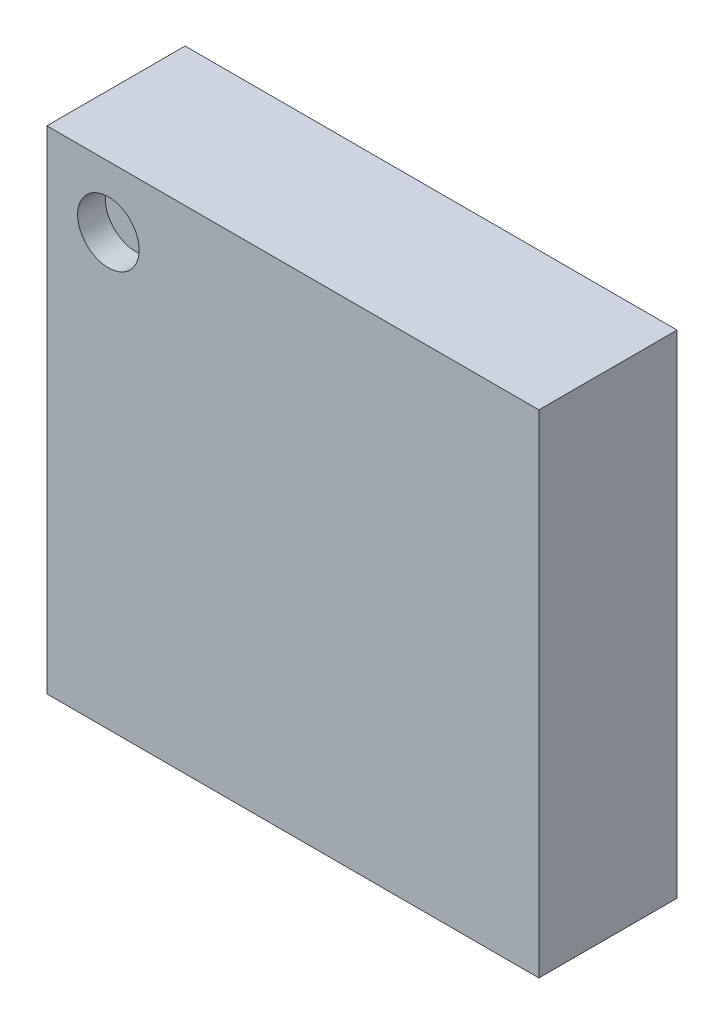
ISO-10303-21;
HEADER;
FILE_DESCRIPTION(('STEP AP214'),'2;1');
FILE_NAME('part.step','',(''),(''),'','','');
FILE_SCHEMA(('AUTOMOTIVE_DESIGN { 1 0 10303 214 1 1 1 1 }'));
ENDSEC;
DATA;
#1=APPLICATION_CONTEXT('core data for automotive mechanical design processes');
#2=APPLICATION_PROTOCOL_DEFINITION('international standard','automotive_design',2000,#1);
#3=PRODUCT_CONTEXT('',#1,'mechanical');
#4=PRODUCT('Part','Part','',(#3));
#5=PRODUCT_RELATED_PRODUCT_CATEGORY('part','',(#4));
#6=PRODUCT_DEFINITION_FORMATION('','',#4);
#7=PRODUCT_DEFINITION_CONTEXT('part definition',#1,'design');
#8=PRODUCT_DEFINITION('design','',#6,#7);
#9=PRODUCT_DEFINITION_SHAPE('','',#8);
#10=(LENGTH_UNIT() NAMED_UNIT(*) SI_UNIT(.MILLI.,.METRE.));
#11=(NAMED_UNIT(*) PLANE_ANGLE_UNIT() SI_UNIT($,.RADIAN.));
#12=(NAMED_UNIT(*) SI_UNIT($,.STERADIAN.) SOLID_ANGLE_UNIT());
#13=UNCERTAINTY_MEASURE_WITH_UNIT(LENGTH_MEASURE(1.E-05),#10,'distance_accuracy_value','');
#14=(GEOMETRIC_REPRESENTATION_CONTEXT(3) GLOBAL_UNCERTAINTY_ASSIGNED_CONTEXT((#13)) GLOBAL_UNIT_ASSIGNED_CONTEXT((#10,
#11,#12)) REPRESENTATION_CONTEXT('',''));
#15=CARTESIAN_POINT('',(0.,0.,0.));
#16=DIRECTION('',(0.,0.,1.));
#17=DIRECTION('',(1.,0.,0.));
#18=AXIS2_PLACEMENT_3D('',#15,#16,#17);
#19=CARTESIAN_POINT('',(-0.356,-0.356,0.2));
#20=DIRECTION('',(1.,0.,0.));
#21=DIRECTION('',(0.,0.,1.));
#22=AXIS2_PLACEMENT_3D('',#19,#20,#21);
#23=PLANE('',#22);
#24=DIRECTION('',(0.,1.,0.));
#25=VECTOR('',#24,1.);
#26=CARTESIAN_POINT('',(-0.356,-0.356,0.4));
#27=LINE('',#26,#25);
#28=CARTESIAN_POINT('',(-0.356,-0.356,0.4));
#29=VERTEX_POINT('',#28);
#30=CARTESIAN_POINT('',(-0.356,0.356,0.4));
#31=VERTEX_POINT('',#30);
#32=EDGE_CURVE('E11',#29,#31,#27,.T.);
#33=ORIENTED_EDGE('',*,*,#32,.T.);
#34=DIRECTION('',(0.,0.,1.));
#35=VECTOR('',#34,1.);
#36=CARTESIAN_POINT('',(-0.356,0.356,0.2));
#37=LINE('',#36,#35);
#38=CARTESIAN_POINT('',(-0.356,0.356,0.2));
#39=VERTEX_POINT('',#38);
#40=EDGE_CURVE('E24',#39,#31,#37,.T.);
#41=ORIENTED_EDGE('',*,*,#40,.F.);
#42=DIRECTION('',(0.,1.,0.));
#43=VECTOR('',#42,1.);
#44=CARTESIAN_POINT('',(-0.356,-0.356,0.2));
#45=LINE('',#44,#43);
#46=CARTESIAN_POINT('',(-0.356,-0.356,0.2));
#47=VERTEX_POINT('',#46);
#48=EDGE_CURVE('E95',#47,#39,#45,.T.);
#49=ORIENTED_EDGE('',*,*,#48,.F.);
#50=DIRECTION('',(0.,0.,1.));
#51=VECTOR('',#50,1.);
#52=CARTESIAN_POINT('',(-0.356,-0.356,0.2));
#53=LINE('',#52,#51);
#54=EDGE_CURVE('E36',#47,#29,#53,.T.);
#55=ORIENTED_EDGE('',*,*,#54,.T.);
#56=EDGE_LOOP('',(#33,#41,#49,#55));
#57=FACE_BOUND('',#56,.T.);
#58=ADVANCED_FACE('F17',(#57),#23,.F.);
#59=CARTESIAN_POINT('',(-0.356,-0.356,0.2));
#60=DIRECTION('',(0.,1.,0.));
#61=DIRECTION('',(0.,0.,1.));
#62=AXIS2_PLACEMENT_3D('',#59,#60,#61);
#63=PLANE('',#62);
#64=DIRECTION('',(0.,0.,1.));
#65=VECTOR('',#64,1.);
#66=CARTESIAN_POINT('',(0.356,-0.356,0.2));
#67=LINE('',#66,#65);
#68=CARTESIAN_POINT('',(0.356,-0.356,0.2));
#69=VERTEX_POINT('',#68);
#70=CARTESIAN_POINT('',(0.356,-0.356,0.4));
#71=VERTEX_POINT('',#70);
#72=EDGE_CURVE('E91',#69,#71,#67,.T.);
#73=ORIENTED_EDGE('',*,*,#72,.T.);
#74=DIRECTION('',(1.,0.,0.));
#75=VECTOR('',#74,1.);
#76=CARTESIAN_POINT('',(-0.356,-0.356,0.4));
#77=LINE('',#76,#75);
#78=EDGE_CURVE('E89',#29,#71,#77,.T.);
#79=ORIENTED_EDGE('',*,*,#78,.F.);
#80=ORIENTED_EDGE('',*,*,#54,.F.);
#81=DIRECTION('',(1.,0.,0.));
#82=VECTOR('',#81,1.);
#83=CARTESIAN_POINT('',(-0.356,-0.356,0.2));
#84=LINE('',#83,#82);
#85=EDGE_CURVE('E87',#47,#69,#84,.T.);
#86=ORIENTED_EDGE('',*,*,#85,.T.);
#87=EDGE_LOOP('',(#73,#79,#80,#86));
#88=FACE_BOUND('',#87,.T.);
#89=ADVANCED_FACE('F109',(#88),#63,.F.);
#90=CARTESIAN_POINT('',(-0.356,-0.356,0.4));
#91=DIRECTION('',(0.,0.,1.));
#92=DIRECTION('',(1.,0.,0.));
#93=AXIS2_PLACEMENT_3D('',#90,#91,#92);
#94=PLANE('',#93);
#95=ORIENTED_EDGE('',*,*,#32,.F.);
#96=ORIENTED_EDGE('',*,*,#78,.T.);
#97=DIRECTION('',(0.,1.,0.));
#98=VECTOR('',#97,1.);
#99=CARTESIAN_POINT('',(0.356,-0.356,0.4));
#100=LINE('',#99,#98);
#101=CARTESIAN_POINT('',(0.356,0.356,0.4));
#102=VERTEX_POINT('',#101);
#103=EDGE_CURVE('E85',#71,#102,#100,.T.);
#104=ORIENTED_EDGE('',*,*,#103,.T.);
#105=DIRECTION('',(1.,0.,0.));
#106=VECTOR('',#105,1.);
#107=CARTESIAN_POINT('',(-0.356,0.356,0.4));
#108=LINE('',#107,#106);
#109=EDGE_CURVE('E83',#31,#102,#108,.T.);
#110=ORIENTED_EDGE('',*,*,#109,.F.);
#111=EDGE_LOOP('',(#95,#96,#104,#110));
#112=FACE_BOUND('',#111,.T.);
#113=CARTESIAN_POINT('',(-0.267,0.267,0.4));
#114=DIRECTION('',(0.,0.,1.));
#115=DIRECTION('',(1.,0.,0.));
#116=AXIS2_PLACEMENT_3D('',#113,#114,#115);
#117=CIRCLE('',#116,0.0445);
#118=CARTESIAN_POINT('',(-0.2225,0.267,0.4));
#119=VERTEX_POINT('',#118);
#120=EDGE_CURVE('E68',#119,#119,#117,.T.);
#121=ORIENTED_EDGE('',*,*,#120,.F.);
#122=EDGE_LOOP('',(#121));
#123=FACE_BOUND('',#122,.T.);
#124=ADVANCED_FACE('F111',(#112,#123),#94,.T.);
#125=CARTESIAN_POINT('',(-0.356,0.356,0.2));
#126=DIRECTION('',(0.,1.,0.));
#127=DIRECTION('',(0.,0.,1.));
#128=AXIS2_PLACEMENT_3D('',#125,#126,#127);
#129=PLANE('',#128);
#130=DIRECTION('',(1.,0.,0.));
#131=VECTOR('',#130,1.);
#132=CARTESIAN_POINT('',(-0.356,0.356,0.2));
#133=LINE('',#132,#131);
#134=CARTESIAN_POINT('',(0.356,0.356,0.2));
#135=VERTEX_POINT('',#134);
#136=EDGE_CURVE('E80',#39,#135,#133,.T.);
#137=ORIENTED_EDGE('',*,*,#136,.F.);
#138=ORIENTED_EDGE('',*,*,#40,.T.);
#139=ORIENTED_EDGE('',*,*,#109,.T.);
#140=DIRECTION('',(0.,0.,1.));
#141=VECTOR('',#140,1.);
#142=CARTESIAN_POINT('',(0.356,0.356,0.2));
#143=LINE('',#142,#141);
#144=EDGE_CURVE('E75',#135,#102,#143,.T.);
#145=ORIENTED_EDGE('',*,*,#144,.F.);
#146=EDGE_LOOP('',(#137,#138,#139,#145));
#147=FACE_BOUND('',#146,.T.);
#148=ADVANCED_FACE('F102',(#147),#129,.T.);
#149=CARTESIAN_POINT('',(-0.356,-0.356,0.2));
#150=DIRECTION('',(0.,0.,1.));
#151=DIRECTION('',(1.,0.,0.));
#152=AXIS2_PLACEMENT_3D('',#149,#150,#151);
#153=PLANE('',#152);
#154=ORIENTED_EDGE('',*,*,#136,.T.);
#155=DIRECTION('',(0.,1.,0.));
#156=VECTOR('',#155,1.);
#157=CARTESIAN_POINT('',(0.356,-0.356,0.2));
#158=LINE('',#157,#156);
#159=EDGE_CURVE('E72',#69,#135,#158,.T.);
#160=ORIENTED_EDGE('',*,*,#159,.F.);
#161=ORIENTED_EDGE('',*,*,#85,.F.);
#162=ORIENTED_EDGE('',*,*,#48,.T.);
#163=EDGE_LOOP('',(#154,#160,#161,#162));
#164=FACE_BOUND('',#163,.T.);
#165=ADVANCED_FACE('F98',(#164),#153,.F.);
#166=CARTESIAN_POINT('',(0.356,-0.356,0.2));
#167=DIRECTION('',(1.,0.,0.));
#168=DIRECTION('',(0.,0.,1.));
#169=AXIS2_PLACEMENT_3D('',#166,#167,#168);
#170=PLANE('',#169);
#171=ORIENTED_EDGE('',*,*,#72,.F.);
#172=ORIENTED_EDGE('',*,*,#159,.T.);
#173=ORIENTED_EDGE('',*,*,#144,.T.);
#174=ORIENTED_EDGE('',*,*,#103,.F.);
#175=EDGE_LOOP('',(#171,#172,#173,#174));
#176=FACE_BOUND('',#175,.T.);
#177=ADVANCED_FACE('F106',(#176),#170,.T.);
#178=CARTESIAN_POINT('',(-0.267,0.267,0.36));
#179=DIRECTION('',(0.,0.,1.));
#180=DIRECTION('',(1.,0.,0.));
#181=AXIS2_PLACEMENT_3D('',#178,#179,#180);
#182=CYLINDRICAL_SURFACE('',#181,0.0445);
#183=CARTESIAN_POINT('',(-0.267,0.267,0.36));
#184=DIRECTION('',(0.,0.,1.));
#185=DIRECTION('',(1.,0.,0.));
#186=AXIS2_PLACEMENT_3D('',#183,#184,#185);
#187=CIRCLE('',#186,0.0445);
#188=CARTESIAN_POINT('',(-0.2225,0.267,0.36));
#189=VERTEX_POINT('',#188);
#190=EDGE_CURVE('E66',#189,#189,#187,.T.);
#191=ORIENTED_EDGE('',*,*,#190,.F.);
#192=DIRECTION('',(0.,0.,1.));
#193=VECTOR('',#192,1.);
#194=CARTESIAN_POINT('',(-0.2225,0.267,0.36));
#195=LINE('',#194,#193);
#196=EDGE_CURVE('E63',#189,#119,#195,.T.);
#197=ORIENTED_EDGE('',*,*,#196,.T.);
#198=ORIENTED_EDGE('',*,*,#120,.T.);
#199=ORIENTED_EDGE('',*,*,#196,.F.);
#200=EDGE_LOOP('',(#191,#197,#198,#199));
#201=FACE_BOUND('',#200,.T.);
#202=ADVANCED_FACE('F65',(#201),#182,.F.);
#203=CARTESIAN_POINT('',(-0.267,0.267,0.36));
#204=DIRECTION('',(0.,0.,1.));
#205=DIRECTION('',(1.,0.,0.));
#206=AXIS2_PLACEMENT_3D('',#203,#204,#205);
#207=PLANE('',#206);
#208=ORIENTED_EDGE('',*,*,#190,.T.);
#209=EDGE_LOOP('',(#208));
#210=FACE_BOUND('',#209,.T.);
#211=ADVANCED_FACE('F71',(#210),#207,.T.);
#212=CLOSED_SHELL('',(#58,#89,#124,#148,#165,#177,#202,#211));
#213=MANIFOLD_SOLID_BREP('B1',#212);
#214=ADVANCED_BREP_SHAPE_REPRESENTATION('',(#18,#213),#14);
#215=SHAPE_DEFINITION_REPRESENTATION(#9,#214);
ENDSEC;
END-ISO-10303-21;
